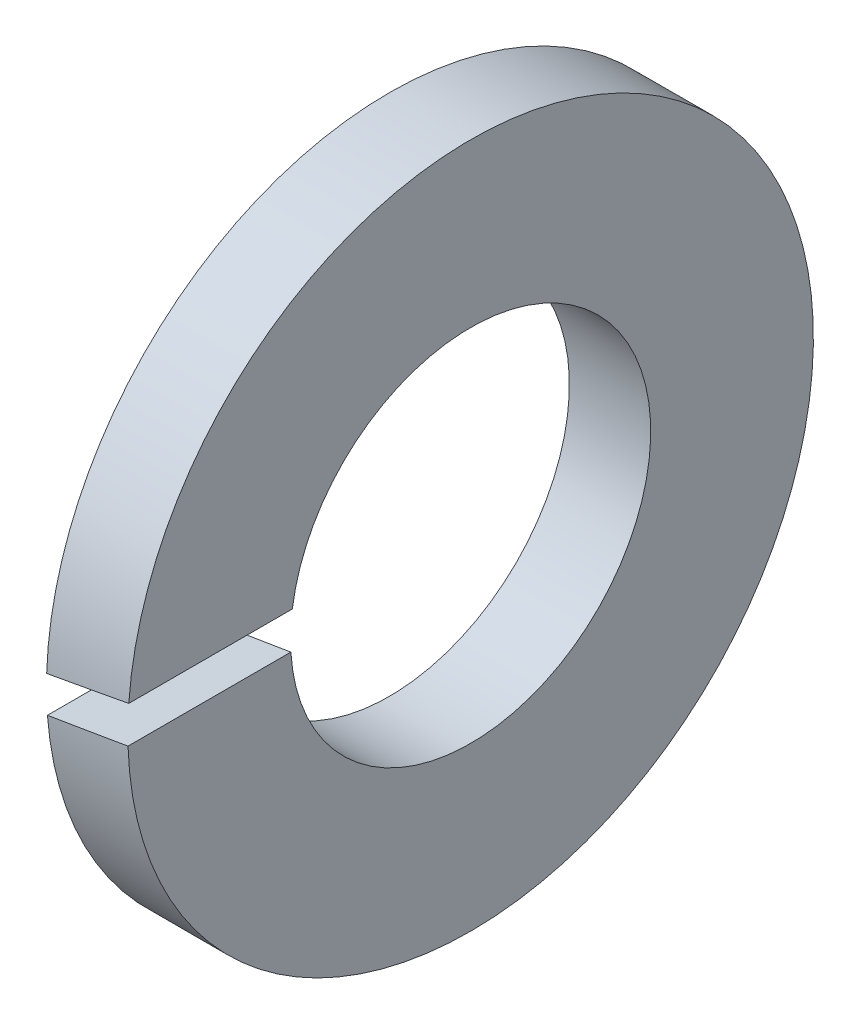
ISO-10303-21;
HEADER;
FILE_DESCRIPTION(('STEP AP214'),'2;1');
FILE_NAME('part.step','',(''),(''),'','','');
FILE_SCHEMA(('AUTOMOTIVE_DESIGN { 1 0 10303 214 1 1 1 1 }'));
ENDSEC;
DATA;
#1=APPLICATION_CONTEXT('core data for automotive mechanical design processes');
#2=APPLICATION_PROTOCOL_DEFINITION('international standard','automotive_design',2000,#1);
#3=PRODUCT_CONTEXT('',#1,'mechanical');
#4=PRODUCT('Part','Part','',(#3));
#5=PRODUCT_RELATED_PRODUCT_CATEGORY('part','',(#4));
#6=PRODUCT_DEFINITION_FORMATION('','',#4);
#7=PRODUCT_DEFINITION_CONTEXT('part definition',#1,'design');
#8=PRODUCT_DEFINITION('design','',#6,#7);
#9=PRODUCT_DEFINITION_SHAPE('','',#8);
#10=(LENGTH_UNIT() NAMED_UNIT(*) SI_UNIT(.MILLI.,.METRE.));
#11=(NAMED_UNIT(*) PLANE_ANGLE_UNIT() SI_UNIT($,.RADIAN.));
#12=(NAMED_UNIT(*) SI_UNIT($,.STERADIAN.) SOLID_ANGLE_UNIT());
#13=UNCERTAINTY_MEASURE_WITH_UNIT(LENGTH_MEASURE(1.E-05),#10,'distance_accuracy_value','');
#14=(GEOMETRIC_REPRESENTATION_CONTEXT(3) GLOBAL_UNCERTAINTY_ASSIGNED_CONTEXT((#13)) GLOBAL_UNIT_ASSIGNED_CONTEXT((#10,
#11,#12)) REPRESENTATION_CONTEXT('',''));
#15=CARTESIAN_POINT('',(0.,0.,0.));
#16=DIRECTION('',(0.,0.,1.));
#17=DIRECTION('',(1.,0.,0.));
#18=AXIS2_PLACEMENT_3D('',#15,#16,#17);
#19=CARTESIAN_POINT('',(0.35,2.25,0.));
#20=DIRECTION('',(1.,0.,0.));
#21=DIRECTION('',(0.,0.,-1.));
#22=AXIS2_PLACEMENT_3D('',#19,#20,#21);
#23=PLANE('',#22);
#24=DIRECTION('',(0.,0.,1.));
#25=VECTOR('',#24,1.);
#26=CARTESIAN_POINT('',(0.35,-0.0956766815943277,0.));
#27=LINE('',#26,#25);
#28=CARTESIAN_POINT('',(0.35,-0.0956766815943277,1.5470442697606));
#29=VERTEX_POINT('',#28);
#30=CARTESIAN_POINT('',(0.35,-0.0956766815943277,2.9484480617096));
#31=VERTEX_POINT('',#30);
#32=EDGE_CURVE('E58',#29,#31,#27,.T.);
#33=ORIENTED_EDGE('',*,*,#32,.T.);
#34=CARTESIAN_POINT('',(0.35,0.,0.));
#35=DIRECTION('',(1.,0.,0.));
#36=DIRECTION('',(0.,0.,-1.));
#37=AXIS2_PLACEMENT_3D('',#34,#35,#36);
#38=CIRCLE('',#37,2.95);
#39=CARTESIAN_POINT('',(0.35,0.219105568090253,2.9418519252389));
#40=VERTEX_POINT('',#39);
#41=EDGE_CURVE('E21',#40,#31,#38,.F.);
#42=ORIENTED_EDGE('',*,*,#41,.F.);
#43=DIRECTION('',(0.,0.,1.));
#44=VECTOR('',#43,1.);
#45=CARTESIAN_POINT('',(0.35,0.219105568090253,0.));
#46=LINE('',#45,#44);
#47=CARTESIAN_POINT('',(0.35,0.219105568090253,1.5344356454514));
#48=VERTEX_POINT('',#47);
#49=EDGE_CURVE('E60',#40,#48,#46,.F.);
#50=ORIENTED_EDGE('',*,*,#49,.T.);
#51=CARTESIAN_POINT('',(0.35,0.,0.));
#52=DIRECTION('',(1.,0.,0.));
#53=DIRECTION('',(0.,0.,-1.));
#54=AXIS2_PLACEMENT_3D('',#51,#52,#53);
#55=CIRCLE('',#54,1.55);
#56=EDGE_CURVE('E76',#48,#29,#55,.F.);
#57=ORIENTED_EDGE('',*,*,#56,.T.);
#58=EDGE_LOOP('',(#33,#42,#50,#57));
#59=FACE_BOUND('',#58,.T.);
#60=ADVANCED_FACE('F18',(#59),#23,.T.);
#61=CARTESIAN_POINT('',(-0.71628089464692,0.031091477350041,0.));
#62=DIRECTION('',(-0.17364817766693,0.984807753012208,0.));
#63=DIRECTION('',(-0.984807753012208,-0.17364817766693,0.));
#64=AXIS2_PLACEMENT_3D('',#61,#62,#63);
#65=PLANE('',#64);
#66=CARTESIAN_POINT('',(-0.892609424887264,0.,0.));
#67=DIRECTION('',(-0.17364817766693,0.984807753012208,0.));
#68=DIRECTION('',(0.984807753012208,0.17364817766693,0.));
#69=AXIS2_PLACEMENT_3D('',#66,#67,#68);
#70=ELLIPSE('',#69,16.9883729252738,2.95);
#71=CARTESIAN_POINT('',(-0.35,0.0956766815943279,2.9484480617096));
#72=VERTEX_POINT('',#71);
#73=EDGE_CURVE('E71',#72,#40,#70,.T.);
#74=ORIENTED_EDGE('',*,*,#73,.F.);
#75=DIRECTION('',(0.,0.,1.));
#76=VECTOR('',#75,1.);
#77=CARTESIAN_POINT('',(-0.35,0.0956766815943281,0.));
#78=LINE('',#77,#76);
#79=CARTESIAN_POINT('',(-0.35,0.0956766815943279,1.5470442697606));
#80=VERTEX_POINT('',#79);
#81=EDGE_CURVE('E66',#80,#72,#78,.T.);
#82=ORIENTED_EDGE('',*,*,#81,.F.);
#83=CARTESIAN_POINT('',(-0.892609424887264,0.,0.));
#84=DIRECTION('',(-0.17364817766693,0.984807753012208,0.));
#85=DIRECTION('',(0.984807753012208,0.17364817766693,0.));
#86=AXIS2_PLACEMENT_3D('',#83,#84,#85);
#87=ELLIPSE('',#86,8.92609424887265,1.55);
#88=EDGE_CURVE('E69',#80,#48,#87,.T.);
#89=ORIENTED_EDGE('',*,*,#88,.T.);
#90=ORIENTED_EDGE('',*,*,#49,.F.);
#91=EDGE_LOOP('',(#74,#82,#89,#90));
#92=FACE_BOUND('',#91,.T.);
#93=ADVANCED_FACE('F68',(#92),#65,.F.);
#94=CARTESIAN_POINT('',(0.,0.,0.));
#95=DIRECTION('',(1.,0.,0.));
#96=DIRECTION('',(0.,0.,-1.));
#97=AXIS2_PLACEMENT_3D('',#94,#95,#96);
#98=CYLINDRICAL_SURFACE('',#97,2.95);
#99=CARTESIAN_POINT('',(-0.35,0.,0.));
#100=DIRECTION('',(1.,0.,0.));
#101=DIRECTION('',(0.,0.,-1.));
#102=AXIS2_PLACEMENT_3D('',#99,#100,#101);
#103=CIRCLE('',#102,2.95);
#104=CARTESIAN_POINT('',(-0.35,-0.219105568090253,2.9418519252389));
#105=VERTEX_POINT('',#104);
#106=EDGE_CURVE('E75',#72,#105,#103,.F.);
#107=ORIENTED_EDGE('',*,*,#106,.F.);
#108=ORIENTED_EDGE('',*,*,#73,.T.);
#109=ORIENTED_EDGE('',*,*,#41,.T.);
#110=CARTESIAN_POINT('',(0.892609424887264,0.,0.));
#111=DIRECTION('',(0.17364817766693,-0.984807753012208,0.));
#112=DIRECTION('',(0.984807753012208,0.17364817766693,0.));
#113=AXIS2_PLACEMENT_3D('',#110,#111,#112);
#114=ELLIPSE('',#113,16.9883729252738,2.95);
#115=EDGE_CURVE('E93',#31,#105,#114,.T.);
#116=ORIENTED_EDGE('',*,*,#115,.T.);
#117=EDGE_LOOP('',(#107,#108,#109,#116));
#118=FACE_BOUND('',#117,.T.);
#119=ADVANCED_FACE('F97',(#118),#98,.T.);
#120=CARTESIAN_POINT('',(0.71628089464692,-0.031091477350041,0.));
#121=DIRECTION('',(0.17364817766693,-0.984807753012208,0.));
#122=DIRECTION('',(0.984807753012208,0.17364817766693,0.));
#123=AXIS2_PLACEMENT_3D('',#120,#121,#122);
#124=PLANE('',#123);
#125=CARTESIAN_POINT('',(0.892609424887264,0.,0.));
#126=DIRECTION('',(0.17364817766693,-0.984807753012208,0.));
#127=DIRECTION('',(0.984807753012208,0.17364817766693,0.));
#128=AXIS2_PLACEMENT_3D('',#125,#126,#127);
#129=ELLIPSE('',#128,8.92609424887265,1.55);
#130=CARTESIAN_POINT('',(-0.35,-0.219105568090253,1.5344356454514));
#131=VERTEX_POINT('',#130);
#132=EDGE_CURVE('E36',#29,#131,#129,.T.);
#133=ORIENTED_EDGE('',*,*,#132,.T.);
#134=DIRECTION('',(0.,0.,1.));
#135=VECTOR('',#134,1.);
#136=CARTESIAN_POINT('',(-0.35,-0.219105568090253,0.));
#137=LINE('',#136,#135);
#138=EDGE_CURVE('E27',#105,#131,#137,.F.);
#139=ORIENTED_EDGE('',*,*,#138,.F.);
#140=ORIENTED_EDGE('',*,*,#115,.F.);
#141=ORIENTED_EDGE('',*,*,#32,.F.);
#142=EDGE_LOOP('',(#133,#139,#140,#141));
#143=FACE_BOUND('',#142,.T.);
#144=ADVANCED_FACE('F98',(#143),#124,.F.);
#145=CARTESIAN_POINT('',(0.,0.,0.));
#146=DIRECTION('',(1.,0.,0.));
#147=DIRECTION('',(0.,0.,-1.));
#148=AXIS2_PLACEMENT_3D('',#145,#146,#147);
#149=CYLINDRICAL_SURFACE('',#148,1.55);
#150=ORIENTED_EDGE('',*,*,#88,.F.);
#151=CARTESIAN_POINT('',(-0.35,0.,0.));
#152=DIRECTION('',(1.,0.,0.));
#153=DIRECTION('',(0.,0.,-1.));
#154=AXIS2_PLACEMENT_3D('',#151,#152,#153);
#155=CIRCLE('',#154,1.55);
#156=EDGE_CURVE('E11',#131,#80,#155,.T.);
#157=ORIENTED_EDGE('',*,*,#156,.F.);
#158=ORIENTED_EDGE('',*,*,#132,.F.);
#159=ORIENTED_EDGE('',*,*,#56,.F.);
#160=EDGE_LOOP('',(#150,#157,#158,#159));
#161=FACE_BOUND('',#160,.T.);
#162=ADVANCED_FACE('F79',(#161),#149,.F.);
#163=CARTESIAN_POINT('',(-0.35,2.25,0.));
#164=DIRECTION('',(-1.,0.,0.));
#165=DIRECTION('',(0.,0.,1.));
#166=AXIS2_PLACEMENT_3D('',#163,#164,#165);
#167=PLANE('',#166);
#168=ORIENTED_EDGE('',*,*,#138,.T.);
#169=ORIENTED_EDGE('',*,*,#156,.T.);
#170=ORIENTED_EDGE('',*,*,#81,.T.);
#171=ORIENTED_EDGE('',*,*,#106,.T.);
#172=EDGE_LOOP('',(#168,#169,#170,#171));
#173=FACE_BOUND('',#172,.T.);
#174=ADVANCED_FACE('F83',(#173),#167,.T.);
#175=CLOSED_SHELL('',(#60,#93,#119,#144,#162,#174));
#176=MANIFOLD_SOLID_BREP('B1',#175);
#177=ADVANCED_BREP_SHAPE_REPRESENTATION('',(#18,#176),#14);
#178=SHAPE_DEFINITION_REPRESENTATION(#9,#177);
ENDSEC;
END-ISO-10303-21;
